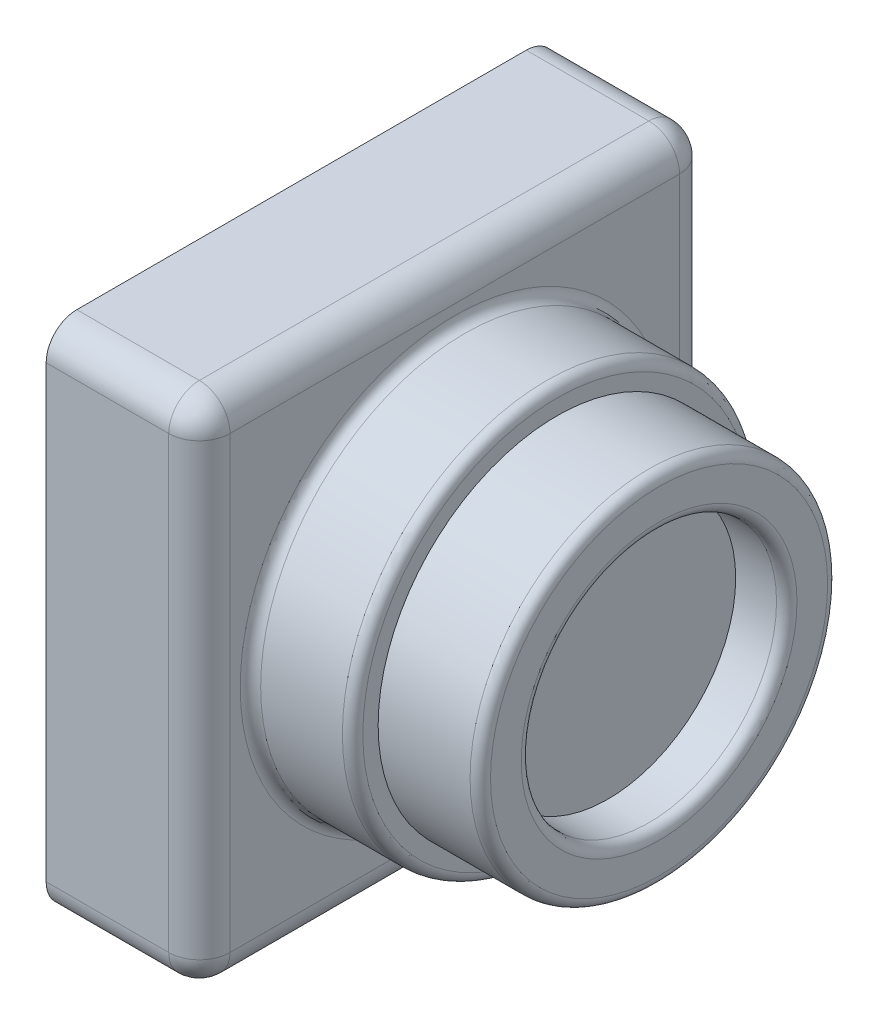
ISO-10303-21;
HEADER;
FILE_DESCRIPTION(('STEP AP214'),'2;1');
FILE_NAME('part.step','',(''),(''),'','','');
FILE_SCHEMA(('AUTOMOTIVE_DESIGN { 1 0 10303 214 1 1 1 1 }'));
ENDSEC;
DATA;
#1=APPLICATION_CONTEXT('core data for automotive mechanical design processes');
#2=APPLICATION_PROTOCOL_DEFINITION('international standard','automotive_design',2000,#1);
#3=PRODUCT_CONTEXT('',#1,'mechanical');
#4=PRODUCT('Part','Part','',(#3));
#5=PRODUCT_RELATED_PRODUCT_CATEGORY('part','',(#4));
#6=PRODUCT_DEFINITION_FORMATION('','',#4);
#7=PRODUCT_DEFINITION_CONTEXT('part definition',#1,'design');
#8=PRODUCT_DEFINITION('design','',#6,#7);
#9=PRODUCT_DEFINITION_SHAPE('','',#8);
#10=(LENGTH_UNIT() NAMED_UNIT(*) SI_UNIT(.MILLI.,.METRE.));
#11=(NAMED_UNIT(*) PLANE_ANGLE_UNIT() SI_UNIT($,.RADIAN.));
#12=(NAMED_UNIT(*) SI_UNIT($,.STERADIAN.) SOLID_ANGLE_UNIT());
#13=UNCERTAINTY_MEASURE_WITH_UNIT(LENGTH_MEASURE(1.E-05),#10,'distance_accuracy_value','');
#14=(GEOMETRIC_REPRESENTATION_CONTEXT(3) GLOBAL_UNCERTAINTY_ASSIGNED_CONTEXT((#13)) GLOBAL_UNIT_ASSIGNED_CONTEXT((#10,
#11,#12)) REPRESENTATION_CONTEXT('',''));
#15=CARTESIAN_POINT('',(0.,0.,0.));
#16=DIRECTION('',(0.,0.,1.));
#17=DIRECTION('',(1.,0.,0.));
#18=AXIS2_PLACEMENT_3D('',#15,#16,#17);
#19=CARTESIAN_POINT('',(35.,0.,0.));
#20=DIRECTION('',(-1.,0.,0.));
#21=DIRECTION('',(0.,0.,1.));
#22=AXIS2_PLACEMENT_3D('',#19,#20,#21);
#23=CYLINDRICAL_SURFACE('',#22,20.);
#24=CARTESIAN_POINT('',(16.,0.,0.));
#25=DIRECTION('',(1.,0.,0.));
#26=DIRECTION('',(0.,0.,-1.));
#27=AXIS2_PLACEMENT_3D('',#24,#25,#26);
#28=CIRCLE('',#27,20.);
#29=CARTESIAN_POINT('',(16.,0.,-20.));
#30=VERTEX_POINT('',#29);
#31=EDGE_CURVE('E235',#30,#30,#28,.T.);
#32=ORIENTED_EDGE('',*,*,#31,.T.);
#33=EDGE_LOOP('',(#32));
#34=FACE_BOUND('',#33,.T.);
#35=CARTESIAN_POINT('',(24.,0.,0.));
#36=DIRECTION('',(1.,0.,0.));
#37=DIRECTION('',(0.,0.,-1.));
#38=AXIS2_PLACEMENT_3D('',#35,#36,#37);
#39=CIRCLE('',#38,20.);
#40=CARTESIAN_POINT('',(24.,0.,-20.));
#41=VERTEX_POINT('',#40);
#42=EDGE_CURVE('E232',#41,#41,#39,.F.);
#43=ORIENTED_EDGE('',*,*,#42,.T.);
#44=EDGE_LOOP('',(#43));
#45=FACE_BOUND('',#44,.T.);
#46=ADVANCED_FACE('F44',(#34,#45),#23,.T.);
#47=CARTESIAN_POINT('',(15.,25.,-25.));
#48=DIRECTION('',(0.,0.,1.));
#49=DIRECTION('',(0.,-1.,0.));
#50=AXIS2_PLACEMENT_3D('',#47,#48,#49);
#51=PLANE('',#50);
#52=DIRECTION('',(0.,1.,0.));
#53=VECTOR('',#52,1.);
#54=CARTESIAN_POINT('',(12.,-25.,-25.));
#55=LINE('',#54,#53);
#56=CARTESIAN_POINT('',(12.,22.,-25.));
#57=VERTEX_POINT('',#56);
#58=CARTESIAN_POINT('',(12.,-22.,-25.));
#59=VERTEX_POINT('',#58);
#60=EDGE_CURVE('E261',#57,#59,#55,.F.);
#61=ORIENTED_EDGE('',*,*,#60,.T.);
#62=DIRECTION('',(-1.,0.,0.));
#63=VECTOR('',#62,1.);
#64=CARTESIAN_POINT('',(15.,-22.,-25.));
#65=LINE('',#64,#63);
#66=CARTESIAN_POINT('',(0.,-22.,-25.));
#67=VERTEX_POINT('',#66);
#68=EDGE_CURVE('E189',#59,#67,#65,.T.);
#69=ORIENTED_EDGE('',*,*,#68,.T.);
#70=DIRECTION('',(0.,1.,0.));
#71=VECTOR('',#70,1.);
#72=CARTESIAN_POINT('',(0.,25.,-25.));
#73=LINE('',#72,#71);
#74=CARTESIAN_POINT('',(0.,22.,-25.));
#75=VERTEX_POINT('',#74);
#76=EDGE_CURVE('E211',#67,#75,#73,.T.);
#77=ORIENTED_EDGE('',*,*,#76,.T.);
#78=DIRECTION('',(-1.,0.,0.));
#79=VECTOR('',#78,1.);
#80=CARTESIAN_POINT('',(15.,22.,-25.));
#81=LINE('',#80,#79);
#82=EDGE_CURVE('E187',#75,#57,#81,.F.);
#83=ORIENTED_EDGE('',*,*,#82,.T.);
#84=EDGE_LOOP('',(#61,#69,#77,#83));
#85=FACE_BOUND('',#84,.T.);
#86=ADVANCED_FACE('F216',(#85),#51,.F.);
#87=CARTESIAN_POINT('',(15.,25.,25.));
#88=DIRECTION('',(0.,-1.,0.));
#89=DIRECTION('',(0.,0.,-1.));
#90=AXIS2_PLACEMENT_3D('',#87,#88,#89);
#91=PLANE('',#90);
#92=DIRECTION('',(0.,0.,1.));
#93=VECTOR('',#92,1.);
#94=CARTESIAN_POINT('',(12.,25.,-25.));
#95=LINE('',#94,#93);
#96=CARTESIAN_POINT('',(12.,25.,22.));
#97=VERTEX_POINT('',#96);
#98=CARTESIAN_POINT('',(12.,25.,-22.));
#99=VERTEX_POINT('',#98);
#100=EDGE_CURVE('E128',#97,#99,#95,.F.);
#101=ORIENTED_EDGE('',*,*,#100,.T.);
#102=DIRECTION('',(-1.,0.,0.));
#103=VECTOR('',#102,1.);
#104=CARTESIAN_POINT('',(15.,25.,-22.));
#105=LINE('',#104,#103);
#106=CARTESIAN_POINT('',(0.,25.,-22.));
#107=VERTEX_POINT('',#106);
#108=EDGE_CURVE('E12',#99,#107,#105,.T.);
#109=ORIENTED_EDGE('',*,*,#108,.T.);
#110=DIRECTION('',(0.,0.,1.));
#111=VECTOR('',#110,1.);
#112=CARTESIAN_POINT('',(0.,25.,25.));
#113=LINE('',#112,#111);
#114=CARTESIAN_POINT('',(0.,25.,22.));
#115=VERTEX_POINT('',#114);
#116=EDGE_CURVE('E213',#107,#115,#113,.T.);
#117=ORIENTED_EDGE('',*,*,#116,.T.);
#118=DIRECTION('',(-1.,0.,0.));
#119=VECTOR('',#118,1.);
#120=CARTESIAN_POINT('',(15.,25.,22.));
#121=LINE('',#120,#119);
#122=EDGE_CURVE('E53',#115,#97,#121,.F.);
#123=ORIENTED_EDGE('',*,*,#122,.T.);
#124=EDGE_LOOP('',(#101,#109,#117,#123));
#125=FACE_BOUND('',#124,.T.);
#126=ADVANCED_FACE('F295',(#125),#91,.F.);
#127=CARTESIAN_POINT('',(15.,25.,25.));
#128=DIRECTION('',(0.,0.,-1.));
#129=DIRECTION('',(0.,1.,0.));
#130=AXIS2_PLACEMENT_3D('',#127,#128,#129);
#131=PLANE('',#130);
#132=DIRECTION('',(0.,-1.,0.));
#133=VECTOR('',#132,1.);
#134=CARTESIAN_POINT('',(0.,25.,25.));
#135=LINE('',#134,#133);
#136=CARTESIAN_POINT('',(0.,22.,25.));
#137=VERTEX_POINT('',#136);
#138=CARTESIAN_POINT('',(0.,-22.,25.));
#139=VERTEX_POINT('',#138);
#140=EDGE_CURVE('E221',#137,#139,#135,.T.);
#141=ORIENTED_EDGE('',*,*,#140,.T.);
#142=DIRECTION('',(-1.,0.,0.));
#143=VECTOR('',#142,1.);
#144=CARTESIAN_POINT('',(15.,-22.,25.));
#145=LINE('',#144,#143);
#146=CARTESIAN_POINT('',(12.,-22.,25.));
#147=VERTEX_POINT('',#146);
#148=EDGE_CURVE('E185',#139,#147,#145,.F.);
#149=ORIENTED_EDGE('',*,*,#148,.T.);
#150=DIRECTION('',(0.,-1.,0.));
#151=VECTOR('',#150,1.);
#152=CARTESIAN_POINT('',(12.,25.,25.));
#153=LINE('',#152,#151);
#154=CARTESIAN_POINT('',(12.,22.,25.));
#155=VERTEX_POINT('',#154);
#156=EDGE_CURVE('E264',#147,#155,#153,.F.);
#157=ORIENTED_EDGE('',*,*,#156,.T.);
#158=DIRECTION('',(-1.,0.,0.));
#159=VECTOR('',#158,1.);
#160=CARTESIAN_POINT('',(15.,22.,25.));
#161=LINE('',#160,#159);
#162=EDGE_CURVE('E183',#155,#137,#161,.T.);
#163=ORIENTED_EDGE('',*,*,#162,.T.);
#164=EDGE_LOOP('',(#141,#149,#157,#163));
#165=FACE_BOUND('',#164,.T.);
#166=ADVANCED_FACE('F310',(#165),#131,.F.);
#167=CARTESIAN_POINT('',(15.,-25.,25.));
#168=DIRECTION('',(0.,1.,0.));
#169=DIRECTION('',(0.,0.,1.));
#170=AXIS2_PLACEMENT_3D('',#167,#168,#169);
#171=PLANE('',#170);
#172=DIRECTION('',(0.,0.,-1.));
#173=VECTOR('',#172,1.);
#174=CARTESIAN_POINT('',(12.,-25.,25.));
#175=LINE('',#174,#173);
#176=CARTESIAN_POINT('',(12.,-25.,-22.));
#177=VERTEX_POINT('',#176);
#178=CARTESIAN_POINT('',(12.,-25.,22.));
#179=VERTEX_POINT('',#178);
#180=EDGE_CURVE('E258',#177,#179,#175,.F.);
#181=ORIENTED_EDGE('',*,*,#180,.T.);
#182=DIRECTION('',(-1.,0.,0.));
#183=VECTOR('',#182,1.);
#184=CARTESIAN_POINT('',(15.,-25.,22.));
#185=LINE('',#184,#183);
#186=CARTESIAN_POINT('',(0.,-25.,22.));
#187=VERTEX_POINT('',#186);
#188=EDGE_CURVE('E174',#179,#187,#185,.T.);
#189=ORIENTED_EDGE('',*,*,#188,.T.);
#190=DIRECTION('',(0.,0.,-1.));
#191=VECTOR('',#190,1.);
#192=CARTESIAN_POINT('',(0.,-25.,25.));
#193=LINE('',#192,#191);
#194=CARTESIAN_POINT('',(0.,-25.,-22.));
#195=VERTEX_POINT('',#194);
#196=EDGE_CURVE('E229',#187,#195,#193,.T.);
#197=ORIENTED_EDGE('',*,*,#196,.T.);
#198=DIRECTION('',(-1.,0.,0.));
#199=VECTOR('',#198,1.);
#200=CARTESIAN_POINT('',(15.,-25.,-22.));
#201=LINE('',#200,#199);
#202=EDGE_CURVE('E172',#195,#177,#201,.F.);
#203=ORIENTED_EDGE('',*,*,#202,.T.);
#204=EDGE_LOOP('',(#181,#189,#197,#203));
#205=FACE_BOUND('',#204,.T.);
#206=ADVANCED_FACE('F304',(#205),#171,.F.);
#207=CARTESIAN_POINT('',(15.,0.,0.));
#208=DIRECTION('',(1.,0.,0.));
#209=DIRECTION('',(0.,0.,-1.));
#210=AXIS2_PLACEMENT_3D('',#207,#208,#209);
#211=PLANE('',#210);
#212=DIRECTION('',(0.,-1.,0.));
#213=VECTOR('',#212,1.);
#214=CARTESIAN_POINT('',(15.,-25.,22.));
#215=LINE('',#214,#213);
#216=CARTESIAN_POINT('',(15.,22.,22.));
#217=VERTEX_POINT('',#216);
#218=CARTESIAN_POINT('',(15.,-22.,22.));
#219=VERTEX_POINT('',#218);
#220=EDGE_CURVE('E142',#217,#219,#215,.T.);
#221=ORIENTED_EDGE('',*,*,#220,.T.);
#222=DIRECTION('',(0.,0.,-1.));
#223=VECTOR('',#222,1.);
#224=CARTESIAN_POINT('',(15.,-22.,-25.));
#225=LINE('',#224,#223);
#226=CARTESIAN_POINT('',(15.,-22.,-22.));
#227=VERTEX_POINT('',#226);
#228=EDGE_CURVE('E256',#219,#227,#225,.T.);
#229=ORIENTED_EDGE('',*,*,#228,.T.);
#230=DIRECTION('',(0.,1.,0.));
#231=VECTOR('',#230,1.);
#232=CARTESIAN_POINT('',(15.,25.,-22.));
#233=LINE('',#232,#231);
#234=CARTESIAN_POINT('',(15.,22.,-22.));
#235=VERTEX_POINT('',#234);
#236=EDGE_CURVE('E145',#227,#235,#233,.T.);
#237=ORIENTED_EDGE('',*,*,#236,.T.);
#238=DIRECTION('',(0.,0.,1.));
#239=VECTOR('',#238,1.);
#240=CARTESIAN_POINT('',(15.,22.,25.));
#241=LINE('',#240,#239);
#242=EDGE_CURVE('E127',#235,#217,#241,.T.);
#243=ORIENTED_EDGE('',*,*,#242,.T.);
#244=EDGE_LOOP('',(#221,#229,#237,#243));
#245=FACE_BOUND('',#244,.T.);
#246=CARTESIAN_POINT('',(15.,0.,0.));
#247=DIRECTION('',(1.,0.,0.));
#248=DIRECTION('',(0.,0.,-1.));
#249=AXIS2_PLACEMENT_3D('',#246,#247,#248);
#250=CIRCLE('',#249,21.);
#251=CARTESIAN_POINT('',(15.,0.,-21.));
#252=VERTEX_POINT('',#251);
#253=EDGE_CURVE('E238',#252,#252,#250,.F.);
#254=ORIENTED_EDGE('',*,*,#253,.T.);
#255=EDGE_LOOP('',(#254));
#256=FACE_BOUND('',#255,.T.);
#257=ADVANCED_FACE('F139',(#245,#256),#211,.T.);
#258=CARTESIAN_POINT('',(0.,0.,0.));
#259=DIRECTION('',(1.,0.,0.));
#260=DIRECTION('',(0.,0.,-1.));
#261=AXIS2_PLACEMENT_3D('',#258,#259,#260);
#262=PLANE('',#261);
#263=ORIENTED_EDGE('',*,*,#196,.F.);
#264=CARTESIAN_POINT('',(0.,-22.,22.));
#265=DIRECTION('',(1.,0.,0.));
#266=DIRECTION('',(0.,0.,-1.));
#267=AXIS2_PLACEMENT_3D('',#264,#265,#266);
#268=CIRCLE('',#267,3.);
#269=EDGE_CURVE('E181',#187,#139,#268,.F.);
#270=ORIENTED_EDGE('',*,*,#269,.T.);
#271=ORIENTED_EDGE('',*,*,#140,.F.);
#272=CARTESIAN_POINT('',(0.,22.,22.));
#273=DIRECTION('',(1.,0.,0.));
#274=DIRECTION('',(0.,0.,-1.));
#275=AXIS2_PLACEMENT_3D('',#272,#273,#274);
#276=CIRCLE('',#275,3.);
#277=EDGE_CURVE('E61',#137,#115,#276,.F.);
#278=ORIENTED_EDGE('',*,*,#277,.T.);
#279=ORIENTED_EDGE('',*,*,#116,.F.);
#280=CARTESIAN_POINT('',(0.,22.,-22.));
#281=DIRECTION('',(1.,0.,0.));
#282=DIRECTION('',(0.,0.,-1.));
#283=AXIS2_PLACEMENT_3D('',#280,#281,#282);
#284=CIRCLE('',#283,3.);
#285=EDGE_CURVE('E177',#107,#75,#284,.F.);
#286=ORIENTED_EDGE('',*,*,#285,.T.);
#287=ORIENTED_EDGE('',*,*,#76,.F.);
#288=CARTESIAN_POINT('',(0.,-22.,-22.));
#289=DIRECTION('',(1.,0.,0.));
#290=DIRECTION('',(0.,0.,-1.));
#291=AXIS2_PLACEMENT_3D('',#288,#289,#290);
#292=CIRCLE('',#291,3.);
#293=EDGE_CURVE('E179',#67,#195,#292,.F.);
#294=ORIENTED_EDGE('',*,*,#293,.T.);
#295=EDGE_LOOP('',(#263,#270,#271,#278,#279,#286,#287,#294));
#296=FACE_BOUND('',#295,.T.);
#297=ADVANCED_FACE('F210',(#296),#262,.F.);
#298=CARTESIAN_POINT('',(25.,0.,0.));
#299=DIRECTION('',(1.,0.,0.));
#300=DIRECTION('',(0.,0.,-1.));
#301=AXIS2_PLACEMENT_3D('',#298,#299,#300);
#302=CYLINDRICAL_SURFACE('',#301,17.5);
#303=CARTESIAN_POINT('',(34.,0.,0.));
#304=DIRECTION('',(1.,0.,0.));
#305=DIRECTION('',(0.,0.,-1.));
#306=AXIS2_PLACEMENT_3D('',#303,#304,#305);
#307=CIRCLE('',#306,17.5);
#308=CARTESIAN_POINT('',(34.,0.,-17.5));
#309=VERTEX_POINT('',#308);
#310=EDGE_CURVE('E250',#309,#309,#307,.F.);
#311=ORIENTED_EDGE('',*,*,#310,.T.);
#312=EDGE_LOOP('',(#311));
#313=FACE_BOUND('',#312,.T.);
#314=CARTESIAN_POINT('',(25.,0.,0.));
#315=DIRECTION('',(1.,0.,0.));
#316=DIRECTION('',(0.,0.,-1.));
#317=AXIS2_PLACEMENT_3D('',#314,#315,#316);
#318=CIRCLE('',#317,17.5);
#319=CARTESIAN_POINT('',(25.,0.,-17.5));
#320=VERTEX_POINT('',#319);
#321=EDGE_CURVE('E219',#320,#320,#318,.T.);
#322=ORIENTED_EDGE('',*,*,#321,.T.);
#323=EDGE_LOOP('',(#322));
#324=FACE_BOUND('',#323,.T.);
#325=ADVANCED_FACE('F307',(#313,#324),#302,.T.);
#326=CARTESIAN_POINT('',(25.,0.,0.));
#327=DIRECTION('',(1.,0.,0.));
#328=DIRECTION('',(0.,0.,-1.));
#329=AXIS2_PLACEMENT_3D('',#326,#327,#328);
#330=PLANE('',#329);
#331=CARTESIAN_POINT('',(25.,0.,0.));
#332=DIRECTION('',(1.,0.,0.));
#333=DIRECTION('',(0.,0.,-1.));
#334=AXIS2_PLACEMENT_3D('',#331,#332,#333);
#335=CIRCLE('',#334,19.);
#336=CARTESIAN_POINT('',(25.,0.,-19.));
#337=VERTEX_POINT('',#336);
#338=EDGE_CURVE('E155',#337,#337,#335,.T.);
#339=ORIENTED_EDGE('',*,*,#338,.T.);
#340=EDGE_LOOP('',(#339));
#341=FACE_BOUND('',#340,.T.);
#342=ORIENTED_EDGE('',*,*,#321,.F.);
#343=EDGE_LOOP('',(#342));
#344=FACE_BOUND('',#343,.T.);
#345=ADVANCED_FACE('F513',(#341,#344),#330,.T.);
#346=CARTESIAN_POINT('',(35.,0.,0.));
#347=DIRECTION('',(1.,0.,0.));
#348=DIRECTION('',(0.,0.,-1.));
#349=AXIS2_PLACEMENT_3D('',#346,#347,#348);
#350=PLANE('',#349);
#351=CARTESIAN_POINT('',(35.,0.,0.));
#352=DIRECTION('',(1.,0.,0.));
#353=DIRECTION('',(0.,0.,-1.));
#354=AXIS2_PLACEMENT_3D('',#351,#352,#353);
#355=CIRCLE('',#354,13.5);
#356=CARTESIAN_POINT('',(35.,0.,-13.5));
#357=VERTEX_POINT('',#356);
#358=EDGE_CURVE('E247',#357,#357,#355,.F.);
#359=ORIENTED_EDGE('',*,*,#358,.T.);
#360=EDGE_LOOP('',(#359));
#361=FACE_BOUND('',#360,.T.);
#362=CARTESIAN_POINT('',(35.,0.,0.));
#363=DIRECTION('',(1.,0.,0.));
#364=DIRECTION('',(0.,0.,-1.));
#365=AXIS2_PLACEMENT_3D('',#362,#363,#364);
#366=CIRCLE('',#365,16.5);
#367=CARTESIAN_POINT('',(35.,0.,-16.5));
#368=VERTEX_POINT('',#367);
#369=EDGE_CURVE('E244',#368,#368,#366,.T.);
#370=ORIENTED_EDGE('',*,*,#369,.T.);
#371=EDGE_LOOP('',(#370));
#372=FACE_BOUND('',#371,.T.);
#373=ADVANCED_FACE('F300',(#361,#372),#350,.T.);
#374=CARTESIAN_POINT('',(25.,0.,0.));
#375=DIRECTION('',(1.,0.,0.));
#376=DIRECTION('',(0.,0.,-1.));
#377=AXIS2_PLACEMENT_3D('',#374,#375,#376);
#378=CYLINDRICAL_SURFACE('',#377,12.5);
#379=CARTESIAN_POINT('',(34.,0.,0.));
#380=DIRECTION('',(1.,0.,0.));
#381=DIRECTION('',(0.,0.,-1.));
#382=AXIS2_PLACEMENT_3D('',#379,#380,#381);
#383=CIRCLE('',#382,12.5);
#384=CARTESIAN_POINT('',(34.,0.,-12.5));
#385=VERTEX_POINT('',#384);
#386=EDGE_CURVE('E241',#385,#385,#383,.T.);
#387=ORIENTED_EDGE('',*,*,#386,.T.);
#388=EDGE_LOOP('',(#387));
#389=FACE_BOUND('',#388,.T.);
#390=CARTESIAN_POINT('',(30.,0.,0.));
#391=DIRECTION('',(1.,0.,0.));
#392=DIRECTION('',(0.,0.,-1.));
#393=AXIS2_PLACEMENT_3D('',#390,#391,#392);
#394=CIRCLE('',#393,12.5);
#395=CARTESIAN_POINT('',(30.,0.,-12.5));
#396=VERTEX_POINT('',#395);
#397=EDGE_CURVE('E194',#396,#396,#394,.T.);
#398=ORIENTED_EDGE('',*,*,#397,.F.);
#399=EDGE_LOOP('',(#398));
#400=FACE_BOUND('',#399,.T.);
#401=ADVANCED_FACE('F498',(#389,#400),#378,.F.);
#402=CARTESIAN_POINT('',(30.,0.,0.));
#403=DIRECTION('',(1.,0.,0.));
#404=DIRECTION('',(0.,0.,-1.));
#405=AXIS2_PLACEMENT_3D('',#402,#403,#404);
#406=PLANE('',#405);
#407=ORIENTED_EDGE('',*,*,#397,.T.);
#408=EDGE_LOOP('',(#407));
#409=FACE_BOUND('',#408,.T.);
#410=ADVANCED_FACE('F321',(#409),#406,.T.);
#411=CARTESIAN_POINT('',(16.,0.,0.));
#412=DIRECTION('',(1.,0.,0.));
#413=DIRECTION('',(0.,0.,-1.));
#414=AXIS2_PLACEMENT_3D('',#411,#412,#413);
#415=TOROIDAL_SURFACE('',#414,21.,1.);
#416=ORIENTED_EDGE('',*,*,#253,.F.);
#417=EDGE_LOOP('',(#416));
#418=FACE_BOUND('',#417,.T.);
#419=ORIENTED_EDGE('',*,*,#31,.F.);
#420=EDGE_LOOP('',(#419));
#421=FACE_BOUND('',#420,.T.);
#422=ADVANCED_FACE('F317',(#418,#421),#415,.F.);
#423=CARTESIAN_POINT('',(34.,0.,0.));
#424=DIRECTION('',(1.,0.,0.));
#425=DIRECTION('',(0.,0.,-1.));
#426=AXIS2_PLACEMENT_3D('',#423,#424,#425);
#427=TOROIDAL_SURFACE('',#426,13.5,1.);
#428=ORIENTED_EDGE('',*,*,#358,.F.);
#429=EDGE_LOOP('',(#428));
#430=FACE_BOUND('',#429,.T.);
#431=ORIENTED_EDGE('',*,*,#386,.F.);
#432=EDGE_LOOP('',(#431));
#433=FACE_BOUND('',#432,.T.);
#434=ADVANCED_FACE('F320',(#430,#433),#427,.T.);
#435=CARTESIAN_POINT('',(34.,0.,0.));
#436=DIRECTION('',(1.,0.,0.));
#437=DIRECTION('',(0.,0.,-1.));
#438=AXIS2_PLACEMENT_3D('',#435,#436,#437);
#439=TOROIDAL_SURFACE('',#438,16.5,1.);
#440=ORIENTED_EDGE('',*,*,#310,.F.);
#441=EDGE_LOOP('',(#440));
#442=FACE_BOUND('',#441,.T.);
#443=ORIENTED_EDGE('',*,*,#369,.F.);
#444=EDGE_LOOP('',(#443));
#445=FACE_BOUND('',#444,.T.);
#446=ADVANCED_FACE('F325',(#442,#445),#439,.T.);
#447=CARTESIAN_POINT('',(24.,0.,0.));
#448=DIRECTION('',(1.,0.,0.));
#449=DIRECTION('',(0.,0.,-1.));
#450=AXIS2_PLACEMENT_3D('',#447,#448,#449);
#451=TOROIDAL_SURFACE('',#450,19.,1.);
#452=ORIENTED_EDGE('',*,*,#42,.F.);
#453=EDGE_LOOP('',(#452));
#454=FACE_BOUND('',#453,.T.);
#455=ORIENTED_EDGE('',*,*,#338,.F.);
#456=EDGE_LOOP('',(#455));
#457=FACE_BOUND('',#456,.T.);
#458=ADVANCED_FACE('F329',(#454,#457),#451,.T.);
#459=CARTESIAN_POINT('',(12.,22.,0.));
#460=DIRECTION('',(0.,0.,-1.));
#461=DIRECTION('',(-1.,0.,0.));
#462=AXIS2_PLACEMENT_3D('',#459,#460,#461);
#463=CYLINDRICAL_SURFACE('',#462,3.);
#464=ORIENTED_EDGE('',*,*,#242,.F.);
#465=CARTESIAN_POINT('',(12.,22.,-22.));
#466=DIRECTION('',(0.,0.,-1.));
#467=DIRECTION('',(-1.,0.,0.));
#468=AXIS2_PLACEMENT_3D('',#465,#466,#467);
#469=CIRCLE('',#468,3.);
#470=EDGE_CURVE('E132',#235,#99,#469,.F.);
#471=ORIENTED_EDGE('',*,*,#470,.T.);
#472=ORIENTED_EDGE('',*,*,#100,.F.);
#473=CARTESIAN_POINT('',(12.,22.,22.));
#474=DIRECTION('',(0.,0.,-1.));
#475=DIRECTION('',(-1.,0.,0.));
#476=AXIS2_PLACEMENT_3D('',#473,#474,#475);
#477=CIRCLE('',#476,3.);
#478=EDGE_CURVE('E124',#97,#217,#477,.T.);
#479=ORIENTED_EDGE('',*,*,#478,.T.);
#480=EDGE_LOOP('',(#464,#471,#472,#479));
#481=FACE_BOUND('',#480,.T.);
#482=ADVANCED_FACE('F126',(#481),#463,.T.);
#483=CARTESIAN_POINT('',(12.,0.,22.));
#484=DIRECTION('',(0.,1.,0.));
#485=DIRECTION('',(0.,0.,1.));
#486=AXIS2_PLACEMENT_3D('',#483,#484,#485);
#487=CYLINDRICAL_SURFACE('',#486,3.);
#488=ORIENTED_EDGE('',*,*,#156,.F.);
#489=CARTESIAN_POINT('',(12.,-22.,22.));
#490=DIRECTION('',(0.,1.,0.));
#491=DIRECTION('',(0.,0.,1.));
#492=AXIS2_PLACEMENT_3D('',#489,#490,#491);
#493=CIRCLE('',#492,3.);
#494=EDGE_CURVE('E154',#147,#219,#493,.T.);
#495=ORIENTED_EDGE('',*,*,#494,.T.);
#496=ORIENTED_EDGE('',*,*,#220,.F.);
#497=CARTESIAN_POINT('',(12.,22.,22.));
#498=DIRECTION('',(0.,1.,0.));
#499=DIRECTION('',(0.,0.,1.));
#500=AXIS2_PLACEMENT_3D('',#497,#498,#499);
#501=CIRCLE('',#500,3.);
#502=EDGE_CURVE('E151',#217,#155,#501,.F.);
#503=ORIENTED_EDGE('',*,*,#502,.T.);
#504=EDGE_LOOP('',(#488,#495,#496,#503));
#505=FACE_BOUND('',#504,.T.);
#506=ADVANCED_FACE('F150',(#505),#487,.T.);
#507=CARTESIAN_POINT('',(12.,0.,-22.));
#508=DIRECTION('',(0.,-1.,0.));
#509=DIRECTION('',(0.,0.,-1.));
#510=AXIS2_PLACEMENT_3D('',#507,#508,#509);
#511=CYLINDRICAL_SURFACE('',#510,3.);
#512=ORIENTED_EDGE('',*,*,#236,.F.);
#513=CARTESIAN_POINT('',(12.,-22.,-22.));
#514=DIRECTION('',(0.,-1.,0.));
#515=DIRECTION('',(0.,0.,-1.));
#516=AXIS2_PLACEMENT_3D('',#513,#514,#515);
#517=CIRCLE('',#516,3.);
#518=EDGE_CURVE('E133',#227,#59,#517,.F.);
#519=ORIENTED_EDGE('',*,*,#518,.T.);
#520=ORIENTED_EDGE('',*,*,#60,.F.);
#521=CARTESIAN_POINT('',(12.,22.,-22.));
#522=DIRECTION('',(0.,-1.,0.));
#523=DIRECTION('',(0.,0.,-1.));
#524=AXIS2_PLACEMENT_3D('',#521,#522,#523);
#525=CIRCLE('',#524,3.);
#526=EDGE_CURVE('E161',#57,#235,#525,.T.);
#527=ORIENTED_EDGE('',*,*,#526,.T.);
#528=EDGE_LOOP('',(#512,#519,#520,#527));
#529=FACE_BOUND('',#528,.T.);
#530=ADVANCED_FACE('F274',(#529),#511,.T.);
#531=CARTESIAN_POINT('',(12.,-22.,0.));
#532=DIRECTION('',(0.,0.,1.));
#533=DIRECTION('',(1.,0.,0.));
#534=AXIS2_PLACEMENT_3D('',#531,#532,#533);
#535=CYLINDRICAL_SURFACE('',#534,3.);
#536=ORIENTED_EDGE('',*,*,#228,.F.);
#537=CARTESIAN_POINT('',(12.,-22.,22.));
#538=DIRECTION('',(0.,0.,1.));
#539=DIRECTION('',(1.,0.,0.));
#540=AXIS2_PLACEMENT_3D('',#537,#538,#539);
#541=CIRCLE('',#540,3.);
#542=EDGE_CURVE('E159',#219,#179,#541,.F.);
#543=ORIENTED_EDGE('',*,*,#542,.T.);
#544=ORIENTED_EDGE('',*,*,#180,.F.);
#545=CARTESIAN_POINT('',(12.,-22.,-22.));
#546=DIRECTION('',(0.,0.,1.));
#547=DIRECTION('',(1.,0.,0.));
#548=AXIS2_PLACEMENT_3D('',#545,#546,#547);
#549=CIRCLE('',#548,3.);
#550=EDGE_CURVE('E164',#177,#227,#549,.T.);
#551=ORIENTED_EDGE('',*,*,#550,.T.);
#552=EDGE_LOOP('',(#536,#543,#544,#551));
#553=FACE_BOUND('',#552,.T.);
#554=ADVANCED_FACE('F269',(#553),#535,.T.);
#555=CARTESIAN_POINT('',(15.,-22.,22.));
#556=DIRECTION('',(-1.,0.,0.));
#557=DIRECTION('',(0.,0.,1.));
#558=AXIS2_PLACEMENT_3D('',#555,#556,#557);
#559=CYLINDRICAL_SURFACE('',#558,3.);
#560=ORIENTED_EDGE('',*,*,#269,.F.);
#561=ORIENTED_EDGE('',*,*,#188,.F.);
#562=CARTESIAN_POINT('',(12.,-22.,22.));
#563=DIRECTION('',(1.,0.,0.));
#564=DIRECTION('',(0.,0.,-1.));
#565=AXIS2_PLACEMENT_3D('',#562,#563,#564);
#566=CIRCLE('',#565,3.);
#567=EDGE_CURVE('E192',#147,#179,#566,.T.);
#568=ORIENTED_EDGE('',*,*,#567,.F.);
#569=ORIENTED_EDGE('',*,*,#148,.F.);
#570=EDGE_LOOP('',(#560,#561,#568,#569));
#571=FACE_BOUND('',#570,.T.);
#572=ADVANCED_FACE('F336',(#571),#559,.T.);
#573=CARTESIAN_POINT('',(12.,-22.,22.));
#574=DIRECTION('',(0.,0.,1.));
#575=DIRECTION('',(1.,0.,0.));
#576=AXIS2_PLACEMENT_3D('',#573,#574,#575);
#577=SPHERICAL_SURFACE('',#576,3.);
#578=ORIENTED_EDGE('',*,*,#542,.F.);
#579=ORIENTED_EDGE('',*,*,#494,.F.);
#580=ORIENTED_EDGE('',*,*,#567,.T.);
#581=EDGE_LOOP('',(#578,#579,#580));
#582=FACE_BOUND('',#581,.T.);
#583=ADVANCED_FACE('F286',(#582),#577,.T.);
#584=CARTESIAN_POINT('',(15.,-22.,-22.));
#585=DIRECTION('',(-1.,0.,0.));
#586=DIRECTION('',(0.,0.,1.));
#587=AXIS2_PLACEMENT_3D('',#584,#585,#586);
#588=CYLINDRICAL_SURFACE('',#587,3.);
#589=ORIENTED_EDGE('',*,*,#293,.F.);
#590=ORIENTED_EDGE('',*,*,#68,.F.);
#591=CARTESIAN_POINT('',(12.,-22.,-22.));
#592=DIRECTION('',(1.,0.,0.));
#593=DIRECTION('',(0.,0.,-1.));
#594=AXIS2_PLACEMENT_3D('',#591,#592,#593);
#595=CIRCLE('',#594,3.);
#596=EDGE_CURVE('E195',#177,#59,#595,.T.);
#597=ORIENTED_EDGE('',*,*,#596,.F.);
#598=ORIENTED_EDGE('',*,*,#202,.F.);
#599=EDGE_LOOP('',(#589,#590,#597,#598));
#600=FACE_BOUND('',#599,.T.);
#601=ADVANCED_FACE('F276',(#600),#588,.T.);
#602=CARTESIAN_POINT('',(12.,-22.,-22.));
#603=DIRECTION('',(0.,0.,1.));
#604=DIRECTION('',(1.,0.,0.));
#605=AXIS2_PLACEMENT_3D('',#602,#603,#604);
#606=SPHERICAL_SURFACE('',#605,3.);
#607=ORIENTED_EDGE('',*,*,#596,.T.);
#608=ORIENTED_EDGE('',*,*,#518,.F.);
#609=ORIENTED_EDGE('',*,*,#550,.F.);
#610=EDGE_LOOP('',(#607,#608,#609));
#611=FACE_BOUND('',#610,.T.);
#612=ADVANCED_FACE('F278',(#611),#606,.T.);
#613=CARTESIAN_POINT('',(15.,22.,-22.));
#614=DIRECTION('',(-1.,0.,0.));
#615=DIRECTION('',(0.,0.,1.));
#616=AXIS2_PLACEMENT_3D('',#613,#614,#615);
#617=CYLINDRICAL_SURFACE('',#616,3.);
#618=ORIENTED_EDGE('',*,*,#285,.F.);
#619=ORIENTED_EDGE('',*,*,#108,.F.);
#620=CARTESIAN_POINT('',(12.,22.,-22.));
#621=DIRECTION('',(1.,0.,0.));
#622=DIRECTION('',(0.,0.,-1.));
#623=AXIS2_PLACEMENT_3D('',#620,#621,#622);
#624=CIRCLE('',#623,3.);
#625=EDGE_CURVE('E197',#57,#99,#624,.T.);
#626=ORIENTED_EDGE('',*,*,#625,.F.);
#627=ORIENTED_EDGE('',*,*,#82,.F.);
#628=EDGE_LOOP('',(#618,#619,#626,#627));
#629=FACE_BOUND('',#628,.T.);
#630=ADVANCED_FACE('F206',(#629),#617,.T.);
#631=CARTESIAN_POINT('',(12.,22.,-22.));
#632=DIRECTION('',(0.,0.,1.));
#633=DIRECTION('',(1.,0.,0.));
#634=AXIS2_PLACEMENT_3D('',#631,#632,#633);
#635=SPHERICAL_SURFACE('',#634,3.);
#636=ORIENTED_EDGE('',*,*,#625,.T.);
#637=ORIENTED_EDGE('',*,*,#470,.F.);
#638=ORIENTED_EDGE('',*,*,#526,.F.);
#639=EDGE_LOOP('',(#636,#637,#638));
#640=FACE_BOUND('',#639,.T.);
#641=ADVANCED_FACE('F202',(#640),#635,.T.);
#642=CARTESIAN_POINT('',(15.,22.,22.));
#643=DIRECTION('',(-1.,0.,0.));
#644=DIRECTION('',(0.,0.,1.));
#645=AXIS2_PLACEMENT_3D('',#642,#643,#644);
#646=CYLINDRICAL_SURFACE('',#645,3.);
#647=ORIENTED_EDGE('',*,*,#277,.F.);
#648=ORIENTED_EDGE('',*,*,#162,.F.);
#649=CARTESIAN_POINT('',(12.,22.,22.));
#650=DIRECTION('',(1.,0.,0.));
#651=DIRECTION('',(0.,0.,-1.));
#652=AXIS2_PLACEMENT_3D('',#649,#650,#651);
#653=CIRCLE('',#652,3.);
#654=EDGE_CURVE('E48',#97,#155,#653,.T.);
#655=ORIENTED_EDGE('',*,*,#654,.F.);
#656=ORIENTED_EDGE('',*,*,#122,.F.);
#657=EDGE_LOOP('',(#647,#648,#655,#656));
#658=FACE_BOUND('',#657,.T.);
#659=ADVANCED_FACE('F46',(#658),#646,.T.);
#660=CARTESIAN_POINT('',(12.,22.,22.));
#661=DIRECTION('',(0.,0.,1.));
#662=DIRECTION('',(1.,0.,0.));
#663=AXIS2_PLACEMENT_3D('',#660,#661,#662);
#664=SPHERICAL_SURFACE('',#663,3.);
#665=ORIENTED_EDGE('',*,*,#502,.F.);
#666=ORIENTED_EDGE('',*,*,#478,.F.);
#667=ORIENTED_EDGE('',*,*,#654,.T.);
#668=EDGE_LOOP('',(#665,#666,#667));
#669=FACE_BOUND('',#668,.T.);
#670=ADVANCED_FACE('F157',(#669),#664,.T.);
#671=CLOSED_SHELL('',(#46,#86,#126,#166,#206,#257,#297,#325,#345,#373,#401,#410,#422,#434,#446,
#458,#482,#506,#530,#554,#572,#583,#601,#612,#630,#641,#659,#670));
#672=MANIFOLD_SOLID_BREP('B2',#671);
#673=ADVANCED_BREP_SHAPE_REPRESENTATION('',(#18,#672),#14);
#674=SHAPE_DEFINITION_REPRESENTATION(#9,#673);
ENDSEC;
END-ISO-10303-21;
